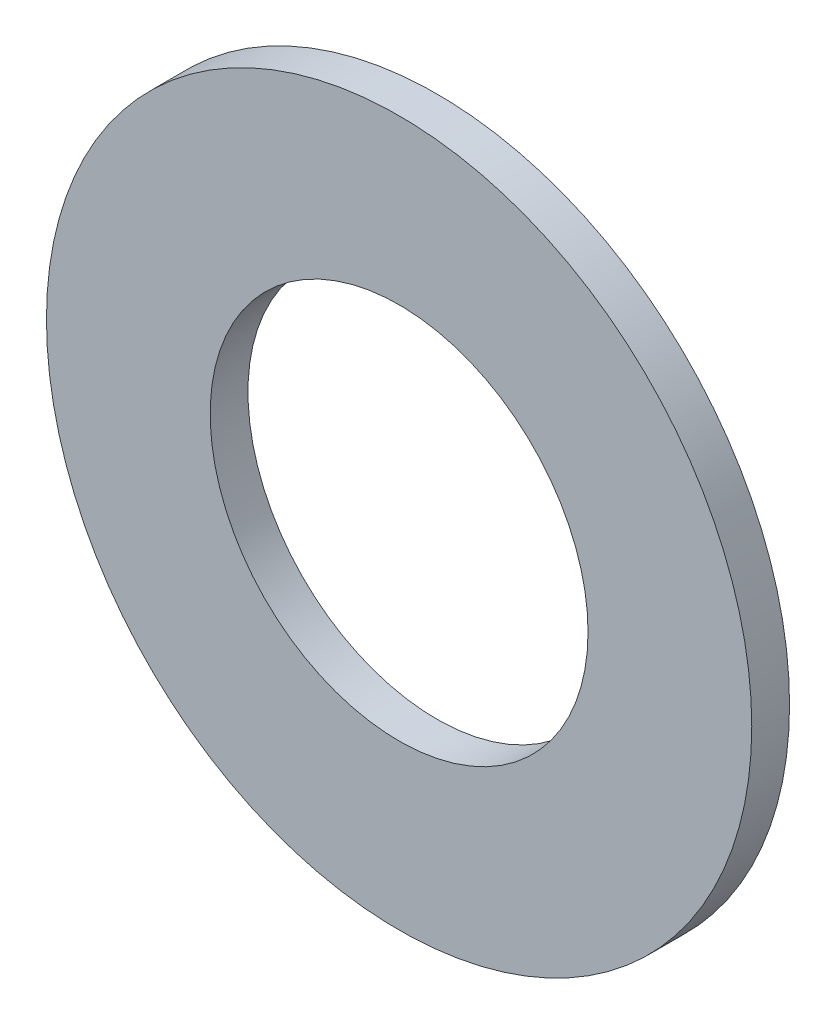
ISO-10303-21;
HEADER;
FILE_DESCRIPTION(('STEP AP214'),'2;1');
FILE_NAME('part.step','',(''),(''),'','','');
FILE_SCHEMA(('AUTOMOTIVE_DESIGN { 1 0 10303 214 1 1 1 1 }'));
ENDSEC;
DATA;
#1=APPLICATION_CONTEXT('core data for automotive mechanical design processes');
#2=APPLICATION_PROTOCOL_DEFINITION('international standard','automotive_design',2000,#1);
#3=PRODUCT_CONTEXT('',#1,'mechanical');
#4=PRODUCT('Part','Part','',(#3));
#5=PRODUCT_RELATED_PRODUCT_CATEGORY('part','',(#4));
#6=PRODUCT_DEFINITION_FORMATION('','',#4);
#7=PRODUCT_DEFINITION_CONTEXT('part definition',#1,'design');
#8=PRODUCT_DEFINITION('design','',#6,#7);
#9=PRODUCT_DEFINITION_SHAPE('','',#8);
#10=(LENGTH_UNIT() NAMED_UNIT(*) SI_UNIT(.MILLI.,.METRE.));
#11=(NAMED_UNIT(*) PLANE_ANGLE_UNIT() SI_UNIT($,.RADIAN.));
#12=(NAMED_UNIT(*) SI_UNIT($,.STERADIAN.) SOLID_ANGLE_UNIT());
#13=UNCERTAINTY_MEASURE_WITH_UNIT(LENGTH_MEASURE(1.E-05),#10,'distance_accuracy_value','');
#14=(GEOMETRIC_REPRESENTATION_CONTEXT(3) GLOBAL_UNCERTAINTY_ASSIGNED_CONTEXT((#13)) GLOBAL_UNIT_ASSIGNED_CONTEXT((#10,
#11,#12)) REPRESENTATION_CONTEXT('',''));
#15=CARTESIAN_POINT('',(0.,0.,0.));
#16=DIRECTION('',(0.,0.,1.));
#17=DIRECTION('',(1.,0.,0.));
#18=AXIS2_PLACEMENT_3D('',#15,#16,#17);
#19=CARTESIAN_POINT('',(0.,0.,1.5));
#20=DIRECTION('',(0.,0.,1.));
#21=DIRECTION('',(1.,0.,0.));
#22=AXIS2_PLACEMENT_3D('',#19,#20,#21);
#23=PLANE('',#22);
#24=CARTESIAN_POINT('',(0.,0.,1.5));
#25=DIRECTION('',(0.,0.,1.));
#26=DIRECTION('',(1.,0.,0.));
#27=AXIS2_PLACEMENT_3D('',#24,#25,#26);
#28=CIRCLE('',#27,14.);
#29=CARTESIAN_POINT('',(14.,0.,1.5));
#30=VERTEX_POINT('',#29);
#31=EDGE_CURVE('E10',#30,#30,#28,.T.);
#32=ORIENTED_EDGE('',*,*,#31,.T.);
#33=EDGE_LOOP('',(#32));
#34=FACE_BOUND('',#33,.T.);
#35=CARTESIAN_POINT('',(0.,0.,1.5));
#36=DIRECTION('',(0.,0.,1.));
#37=DIRECTION('',(1.,0.,0.));
#38=AXIS2_PLACEMENT_3D('',#35,#36,#37);
#39=CIRCLE('',#38,7.5);
#40=CARTESIAN_POINT('',(7.5,0.,1.5));
#41=VERTEX_POINT('',#40);
#42=EDGE_CURVE('E51',#41,#41,#39,.T.);
#43=ORIENTED_EDGE('',*,*,#42,.F.);
#44=EDGE_LOOP('',(#43));
#45=FACE_BOUND('',#44,.T.);
#46=ADVANCED_FACE('F38',(#34,#45),#23,.T.);
#47=CARTESIAN_POINT('',(0.,0.,0.));
#48=DIRECTION('',(0.,0.,1.));
#49=DIRECTION('',(1.,0.,0.));
#50=AXIS2_PLACEMENT_3D('',#47,#48,#49);
#51=PLANE('',#50);
#52=CARTESIAN_POINT('',(0.,0.,0.));
#53=DIRECTION('',(0.,0.,1.));
#54=DIRECTION('',(1.,0.,0.));
#55=AXIS2_PLACEMENT_3D('',#52,#53,#54);
#56=CIRCLE('',#55,14.);
#57=CARTESIAN_POINT('',(14.,0.,0.));
#58=VERTEX_POINT('',#57);
#59=EDGE_CURVE('E42',#58,#58,#56,.T.);
#60=ORIENTED_EDGE('',*,*,#59,.F.);
#61=EDGE_LOOP('',(#60));
#62=FACE_BOUND('',#61,.T.);
#63=CARTESIAN_POINT('',(0.,0.,0.));
#64=DIRECTION('',(0.,0.,1.));
#65=DIRECTION('',(1.,0.,0.));
#66=AXIS2_PLACEMENT_3D('',#63,#64,#65);
#67=CIRCLE('',#66,7.5);
#68=CARTESIAN_POINT('',(7.5,0.,0.));
#69=VERTEX_POINT('',#68);
#70=EDGE_CURVE('E53',#69,#69,#67,.T.);
#71=ORIENTED_EDGE('',*,*,#70,.T.);
#72=EDGE_LOOP('',(#71));
#73=FACE_BOUND('',#72,.T.);
#74=ADVANCED_FACE('F65',(#62,#73),#51,.F.);
#75=CARTESIAN_POINT('',(0.,0.,1.5));
#76=DIRECTION('',(0.,0.,-1.));
#77=DIRECTION('',(-1.,0.,0.));
#78=AXIS2_PLACEMENT_3D('',#75,#76,#77);
#79=CYLINDRICAL_SURFACE('',#78,14.);
#80=ORIENTED_EDGE('',*,*,#31,.F.);
#81=EDGE_LOOP('',(#80));
#82=FACE_BOUND('',#81,.T.);
#83=ORIENTED_EDGE('',*,*,#59,.T.);
#84=EDGE_LOOP('',(#83));
#85=FACE_BOUND('',#84,.T.);
#86=ADVANCED_FACE('F40',(#82,#85),#79,.T.);
#87=CARTESIAN_POINT('',(0.,0.,1.5));
#88=DIRECTION('',(0.,0.,-1.));
#89=DIRECTION('',(-1.,0.,0.));
#90=AXIS2_PLACEMENT_3D('',#87,#88,#89);
#91=CYLINDRICAL_SURFACE('',#90,7.5);
#92=ORIENTED_EDGE('',*,*,#42,.T.);
#93=EDGE_LOOP('',(#92));
#94=FACE_BOUND('',#93,.T.);
#95=ORIENTED_EDGE('',*,*,#70,.F.);
#96=EDGE_LOOP('',(#95));
#97=FACE_BOUND('',#96,.T.);
#98=ADVANCED_FACE('F61',(#94,#97),#91,.F.);
#99=CLOSED_SHELL('',(#46,#74,#86,#98));
#100=MANIFOLD_SOLID_BREP('B2',#99);
#101=ADVANCED_BREP_SHAPE_REPRESENTATION('',(#18,#100),#14);
#102=SHAPE_DEFINITION_REPRESENTATION(#9,#101);
ENDSEC;
END-ISO-10303-21;
